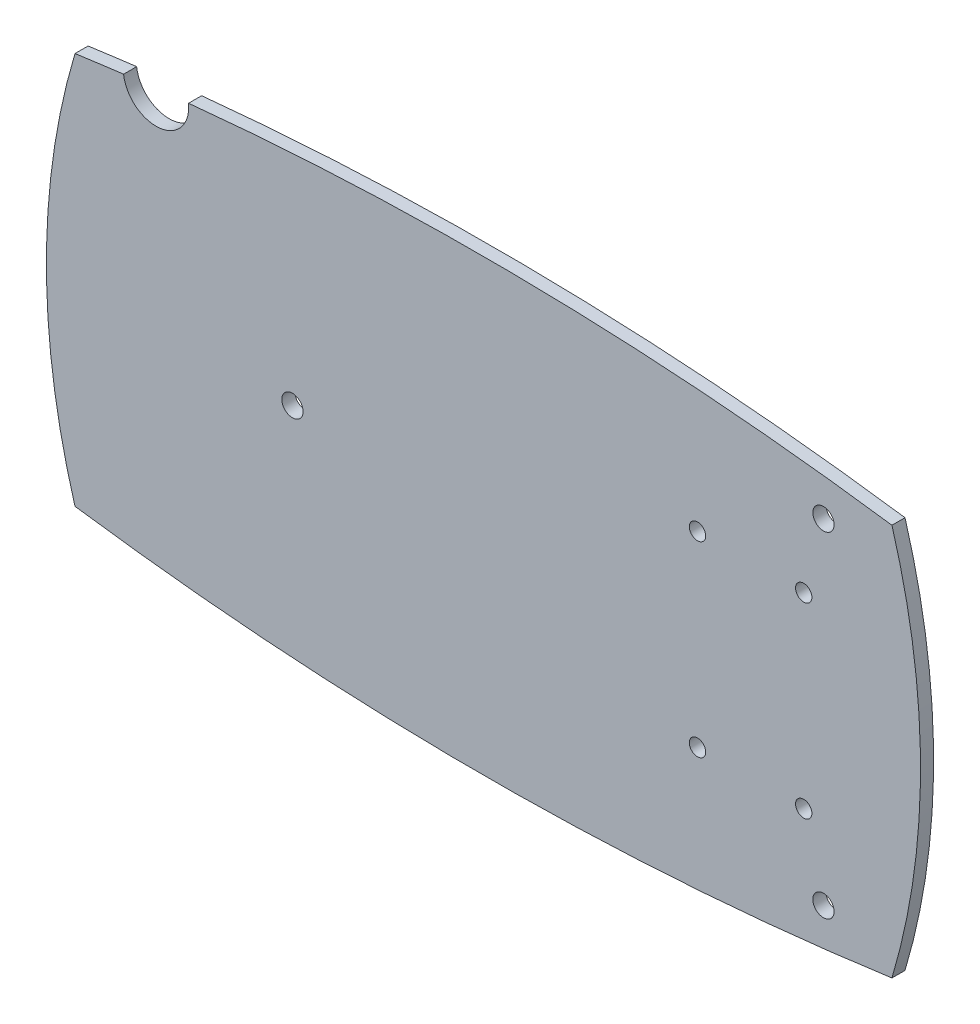
ISO-10303-21;
HEADER;
FILE_DESCRIPTION(('STEP AP214'),'2;1');
FILE_NAME('part.step','',(''),(''),'','','');
FILE_SCHEMA(('AUTOMOTIVE_DESIGN { 1 0 10303 214 1 1 1 1 }'));
ENDSEC;
DATA;
#1=APPLICATION_CONTEXT('core data for automotive mechanical design processes');
#2=APPLICATION_PROTOCOL_DEFINITION('international standard','automotive_design',2000,#1);
#3=PRODUCT_CONTEXT('',#1,'mechanical');
#4=PRODUCT('Part','Part','',(#3));
#5=PRODUCT_RELATED_PRODUCT_CATEGORY('part','',(#4));
#6=PRODUCT_DEFINITION_FORMATION('','',#4);
#7=PRODUCT_DEFINITION_CONTEXT('part definition',#1,'design');
#8=PRODUCT_DEFINITION('design','',#6,#7);
#9=PRODUCT_DEFINITION_SHAPE('','',#8);
#10=(LENGTH_UNIT() NAMED_UNIT(*) SI_UNIT(.MILLI.,.METRE.));
#11=(NAMED_UNIT(*) PLANE_ANGLE_UNIT() SI_UNIT($,.RADIAN.));
#12=(NAMED_UNIT(*) SI_UNIT($,.STERADIAN.) SOLID_ANGLE_UNIT());
#13=UNCERTAINTY_MEASURE_WITH_UNIT(LENGTH_MEASURE(1.E-05),#10,'distance_accuracy_value','');
#14=(GEOMETRIC_REPRESENTATION_CONTEXT(3) GLOBAL_UNCERTAINTY_ASSIGNED_CONTEXT((#13)) GLOBAL_UNIT_ASSIGNED_CONTEXT((#10,
#11,#12)) REPRESENTATION_CONTEXT('',''));
#15=CARTESIAN_POINT('',(0.,0.,0.));
#16=DIRECTION('',(0.,0.,1.));
#17=DIRECTION('',(1.,0.,0.));
#18=AXIS2_PLACEMENT_3D('',#15,#16,#17);
#19=CARTESIAN_POINT('',(-1.184910226,11.2255424561,1.6));
#20=DIRECTION('',(0.,0.,1.));
#21=DIRECTION('',(1.,0.,0.));
#22=AXIS2_PLACEMENT_3D('',#19,#20,#21);
#23=PLANE('',#22);
#24=CARTESIAN_POINT('',(26.6173845785,0.,1.6));
#25=DIRECTION('',(0.,0.,1.));
#26=DIRECTION('',(1.,0.,0.));
#27=AXIS2_PLACEMENT_3D('',#24,#25,#26);
#28=CIRCLE('',#27,1.3);
#29=CARTESIAN_POINT('',(27.9173845785,0.,1.6));
#30=VERTEX_POINT('',#29);
#31=EDGE_CURVE('E122',#30,#30,#28,.F.);
#32=ORIENTED_EDGE('',*,*,#31,.T.);
#33=EDGE_LOOP('',(#32));
#34=FACE_BOUND('',#33,.T.);
#35=CARTESIAN_POINT('',(91.6173845785,20.5,1.60000000083001));
#36=DIRECTION('',(0.,0.,1.));
#37=DIRECTION('',(1.,0.,0.));
#38=AXIS2_PLACEMENT_3D('',#35,#36,#37);
#39=CIRCLE('',#38,1.3);
#40=CARTESIAN_POINT('',(92.9173845785,20.5,1.60000000083001));
#41=VERTEX_POINT('',#40);
#42=EDGE_CURVE('E125',#41,#41,#39,.F.);
#43=ORIENTED_EDGE('',*,*,#42,.T.);
#44=EDGE_LOOP('',(#43));
#45=FACE_BOUND('',#44,.T.);
#46=CARTESIAN_POINT('',(91.6173845785,-20.5,1.60000000083001));
#47=DIRECTION('',(0.,0.,1.));
#48=DIRECTION('',(1.,0.,0.));
#49=AXIS2_PLACEMENT_3D('',#46,#47,#48);
#50=CIRCLE('',#49,1.3);
#51=CARTESIAN_POINT('',(92.9173845785,-20.5,1.60000000083001));
#52=VERTEX_POINT('',#51);
#53=EDGE_CURVE('E128',#52,#52,#50,.F.);
#54=ORIENTED_EDGE('',*,*,#53,.T.);
#55=EDGE_LOOP('',(#54));
#56=FACE_BOUND('',#55,.T.);
#57=CARTESIAN_POINT('',(89.2,-11.45,1.60000000066));
#58=DIRECTION('',(0.,0.,-1.));
#59=DIRECTION('',(-1.,0.,0.));
#60=AXIS2_PLACEMENT_3D('',#57,#58,#59);
#61=CIRCLE('',#60,1.);
#62=CARTESIAN_POINT('',(88.2,-11.45,1.60000000066));
#63=VERTEX_POINT('',#62);
#64=EDGE_CURVE('E131',#63,#63,#61,.T.);
#65=ORIENTED_EDGE('',*,*,#64,.T.);
#66=EDGE_LOOP('',(#65));
#67=FACE_BOUND('',#66,.T.);
#68=CARTESIAN_POINT('',(76.2,-11.45,1.60000000066));
#69=DIRECTION('',(0.,0.,-1.));
#70=DIRECTION('',(-1.,0.,0.));
#71=AXIS2_PLACEMENT_3D('',#68,#69,#70);
#72=CIRCLE('',#71,1.);
#73=CARTESIAN_POINT('',(75.2,-11.45,1.60000000066));
#74=VERTEX_POINT('',#73);
#75=EDGE_CURVE('E134',#74,#74,#72,.T.);
#76=ORIENTED_EDGE('',*,*,#75,.T.);
#77=EDGE_LOOP('',(#76));
#78=FACE_BOUND('',#77,.T.);
#79=CARTESIAN_POINT('',(76.2,11.45,1.60000000066));
#80=DIRECTION('',(0.,0.,-1.));
#81=DIRECTION('',(-1.,0.,0.));
#82=AXIS2_PLACEMENT_3D('',#79,#80,#81);
#83=CIRCLE('',#82,1.);
#84=CARTESIAN_POINT('',(75.2,11.45,1.60000000066));
#85=VERTEX_POINT('',#84);
#86=EDGE_CURVE('E137',#85,#85,#83,.T.);
#87=ORIENTED_EDGE('',*,*,#86,.T.);
#88=EDGE_LOOP('',(#87));
#89=FACE_BOUND('',#88,.T.);
#90=CARTESIAN_POINT('',(89.2,11.45,1.60000000066));
#91=DIRECTION('',(0.,0.,-1.));
#92=DIRECTION('',(-1.,0.,0.));
#93=AXIS2_PLACEMENT_3D('',#90,#91,#92);
#94=CIRCLE('',#93,1.);
#95=CARTESIAN_POINT('',(88.2,11.45,1.60000000066));
#96=VERTEX_POINT('',#95);
#97=EDGE_CURVE('E140',#96,#96,#94,.T.);
#98=ORIENTED_EDGE('',*,*,#97,.T.);
#99=EDGE_LOOP('',(#98));
#100=FACE_BOUND('',#99,.T.);
#101=CARTESIAN_POINT('',(19.4642857143,0.,1.59999999963));
#102=DIRECTION('',(0.,0.,-1.));
#103=DIRECTION('',(-1.,0.,0.));
#104=AXIS2_PLACEMENT_3D('',#101,#102,#103);
#105=CIRCLE('',#104,84.0357142857);
#106=CARTESIAN_POINT('',(99.9999999999995,24.0000000000014,1.59999999963));
#107=VERTEX_POINT('',#106);
#108=CARTESIAN_POINT('',(99.9999999999992,-24.0000000000007,1.59999999963));
#109=VERTEX_POINT('',#108);
#110=EDGE_CURVE('E149',#107,#109,#105,.T.);
#111=ORIENTED_EDGE('',*,*,#110,.F.);
#112=CARTESIAN_POINT('',(50.,-331.392857143,1.6));
#113=DIRECTION('',(0.,0.,1.));
#114=DIRECTION('',(1.,0.,0.));
#115=AXIS2_PLACEMENT_3D('',#112,#113,#114);
#116=CIRCLE('',#115,358.892857143);
#117=CARTESIAN_POINT('',(13.8981014505967,25.6795946499009,1.6));
#118=VERTEX_POINT('',#117);
#119=EDGE_CURVE('E146',#118,#107,#116,.F.);
#120=ORIENTED_EDGE('',*,*,#119,.F.);
#121=CARTESIAN_POINT('',(9.92069465196,25.2550535351,1.6));
#122=DIRECTION('',(0.,0.,-1.));
#123=DIRECTION('',(-1.,0.,0.));
#124=AXIS2_PLACEMENT_3D('',#121,#122,#123);
#125=CIRCLE('',#124,4.);
#126=CARTESIAN_POINT('',(5.94826649118717,24.7862097364879,1.59999999981499));
#127=VERTEX_POINT('',#126);
#128=EDGE_CURVE('E81',#118,#127,#125,.T.);
#129=ORIENTED_EDGE('',*,*,#128,.T.);
#130=CARTESIAN_POINT('',(50.,-331.392857143,1.59999999963));
#131=DIRECTION('',(0.,0.,1.));
#132=DIRECTION('',(1.,0.,0.));
#133=AXIS2_PLACEMENT_3D('',#130,#131,#132);
#134=CIRCLE('',#133,358.892857143);
#135=CARTESIAN_POINT('',(8.11850586757146E-13,24.0000000000007,1.59999999963));
#136=VERTEX_POINT('',#135);
#137=EDGE_CURVE('E20',#136,#127,#134,.F.);
#138=ORIENTED_EDGE('',*,*,#137,.F.);
#139=CARTESIAN_POINT('',(80.5357142857,0.,1.59999999963));
#140=DIRECTION('',(0.,0.,1.));
#141=DIRECTION('',(1.,0.,0.));
#142=AXIS2_PLACEMENT_3D('',#139,#140,#141);
#143=CIRCLE('',#142,84.0357142857);
#144=CARTESIAN_POINT('',(5.96744875736022E-13,-24.0000000000014,1.59999999963));
#145=VERTEX_POINT('',#144);
#146=EDGE_CURVE('E67',#145,#136,#143,.F.);
#147=ORIENTED_EDGE('',*,*,#146,.F.);
#148=CARTESIAN_POINT('',(50.,331.392857143,1.59999999963));
#149=DIRECTION('',(0.,0.,-1.));
#150=DIRECTION('',(-1.,0.,0.));
#151=AXIS2_PLACEMENT_3D('',#148,#149,#150);
#152=CIRCLE('',#151,358.892857143);
#153=EDGE_CURVE('E89',#109,#145,#152,.T.);
#154=ORIENTED_EDGE('',*,*,#153,.F.);
#155=EDGE_LOOP('',(#111,#120,#129,#138,#147,#154));
#156=FACE_BOUND('',#155,.T.);
#157=ADVANCED_FACE('F17',(#34,#45,#56,#67,#78,#89,#100,#156),#23,.T.);
#158=CARTESIAN_POINT('',(50.,-331.392857143,0.));
#159=DIRECTION('',(0.,0.,1.));
#160=DIRECTION('',(1.,0.,0.));
#161=AXIS2_PLACEMENT_3D('',#158,#159,#160);
#162=CYLINDRICAL_SURFACE('',#161,358.892857143);
#163=DIRECTION('',(0.,0.,1.));
#164=VECTOR('',#163,1.);
#165=CARTESIAN_POINT('',(5.55111512312578E-13,23.9999999999998,0.));
#166=LINE('',#165,#164);
#167=CARTESIAN_POINT('',(8.11850586757146E-13,24.0000000000007,1.77024438456849E-10));
#168=VERTEX_POINT('',#167);
#169=EDGE_CURVE('E72',#136,#168,#166,.F.);
#170=ORIENTED_EDGE('',*,*,#169,.F.);
#171=ORIENTED_EDGE('',*,*,#137,.T.);
#172=DIRECTION('',(0.,0.,-1.));
#173=VECTOR('',#172,1.);
#174=CARTESIAN_POINT('',(5.94826649118556,24.7862097364995,1.6));
#175=LINE('',#174,#173);
#176=CARTESIAN_POINT('',(5.94826649118717,24.7862097364879,3.7252904754258E-10));
#177=VERTEX_POINT('',#176);
#178=EDGE_CURVE('E143',#127,#177,#175,.T.);
#179=ORIENTED_EDGE('',*,*,#178,.T.);
#180=CARTESIAN_POINT('',(50.,-331.392857143,3.72529118664E-10));
#181=DIRECTION('',(0.,0.,1.));
#182=DIRECTION('',(1.,0.,0.));
#183=AXIS2_PLACEMENT_3D('',#180,#181,#182);
#184=CIRCLE('',#183,358.892857143);
#185=EDGE_CURVE('E87',#177,#168,#184,.T.);
#186=ORIENTED_EDGE('',*,*,#185,.T.);
#187=EDGE_LOOP('',(#170,#171,#179,#186));
#188=FACE_BOUND('',#187,.T.);
#189=ADVANCED_FACE('F86',(#188),#162,.T.);
#190=CARTESIAN_POINT('',(80.5357142857,0.,0.));
#191=DIRECTION('',(0.,0.,1.));
#192=DIRECTION('',(1.,0.,0.));
#193=AXIS2_PLACEMENT_3D('',#190,#191,#192);
#194=CYLINDRICAL_SURFACE('',#193,84.0357142857);
#195=CARTESIAN_POINT('',(80.5357142857,0.,0.));
#196=DIRECTION('',(0.,0.,1.));
#197=DIRECTION('',(1.,0.,0.));
#198=AXIS2_PLACEMENT_3D('',#195,#196,#197);
#199=CIRCLE('',#198,84.0357142857);
#200=CARTESIAN_POINT('',(5.96744875736022E-13,-24.0000000000014,0.));
#201=VERTEX_POINT('',#200);
#202=EDGE_CURVE('E119',#168,#201,#199,.T.);
#203=ORIENTED_EDGE('',*,*,#202,.T.);
#204=DIRECTION('',(0.,0.,-1.));
#205=VECTOR('',#204,1.);
#206=CARTESIAN_POINT('',(0.,-24.0000000000014,0.));
#207=LINE('',#206,#205);
#208=EDGE_CURVE('E74',#145,#201,#207,.T.);
#209=ORIENTED_EDGE('',*,*,#208,.F.);
#210=ORIENTED_EDGE('',*,*,#146,.T.);
#211=ORIENTED_EDGE('',*,*,#169,.T.);
#212=EDGE_LOOP('',(#203,#209,#210,#211));
#213=FACE_BOUND('',#212,.T.);
#214=ADVANCED_FACE('F70',(#213),#194,.T.);
#215=CARTESIAN_POINT('',(50.,331.392857143,0.));
#216=DIRECTION('',(0.,0.,-1.));
#217=DIRECTION('',(-1.,0.,0.));
#218=AXIS2_PLACEMENT_3D('',#215,#216,#217);
#219=CYLINDRICAL_SURFACE('',#218,358.892857143);
#220=DIRECTION('',(0.,0.,-1.));
#221=VECTOR('',#220,1.);
#222=CARTESIAN_POINT('',(99.9999999999994,-23.9999999999998,0.));
#223=LINE('',#222,#221);
#224=CARTESIAN_POINT('',(99.9999999999992,-24.0000000000007,0.));
#225=VERTEX_POINT('',#224);
#226=EDGE_CURVE('E151',#109,#225,#223,.T.);
#227=ORIENTED_EDGE('',*,*,#226,.F.);
#228=ORIENTED_EDGE('',*,*,#153,.T.);
#229=ORIENTED_EDGE('',*,*,#208,.T.);
#230=CARTESIAN_POINT('',(50.,331.392857143,0.));
#231=DIRECTION('',(0.,0.,-1.));
#232=DIRECTION('',(-1.,0.,0.));
#233=AXIS2_PLACEMENT_3D('',#230,#231,#232);
#234=CIRCLE('',#233,358.892857143);
#235=EDGE_CURVE('E117',#201,#225,#234,.F.);
#236=ORIENTED_EDGE('',*,*,#235,.T.);
#237=EDGE_LOOP('',(#227,#228,#229,#236));
#238=FACE_BOUND('',#237,.T.);
#239=ADVANCED_FACE('F154',(#238),#219,.T.);
#240=CARTESIAN_POINT('',(19.4642857143,0.,0.));
#241=DIRECTION('',(0.,0.,-1.));
#242=DIRECTION('',(-1.,0.,0.));
#243=AXIS2_PLACEMENT_3D('',#240,#241,#242);
#244=CYLINDRICAL_SURFACE('',#243,84.0357142857);
#245=CARTESIAN_POINT('',(19.4642857143,0.,0.));
#246=DIRECTION('',(0.,0.,-1.));
#247=DIRECTION('',(-1.,0.,0.));
#248=AXIS2_PLACEMENT_3D('',#245,#246,#247);
#249=CIRCLE('',#248,84.0357142857);
#250=CARTESIAN_POINT('',(99.9999999999995,24.0000000000014,0.));
#251=VERTEX_POINT('',#250);
#252=EDGE_CURVE('E114',#225,#251,#249,.F.);
#253=ORIENTED_EDGE('',*,*,#252,.T.);
#254=DIRECTION('',(0.,0.,1.));
#255=VECTOR('',#254,1.);
#256=CARTESIAN_POINT('',(100.,24.0000000000014,0.));
#257=LINE('',#256,#255);
#258=EDGE_CURVE('E148',#107,#251,#257,.F.);
#259=ORIENTED_EDGE('',*,*,#258,.F.);
#260=ORIENTED_EDGE('',*,*,#110,.T.);
#261=ORIENTED_EDGE('',*,*,#226,.T.);
#262=EDGE_LOOP('',(#253,#259,#260,#261));
#263=FACE_BOUND('',#262,.T.);
#264=ADVANCED_FACE('F159',(#263),#244,.T.);
#265=CARTESIAN_POINT('',(50.,-331.392857143,0.));
#266=DIRECTION('',(0.,0.,1.));
#267=DIRECTION('',(1.,0.,0.));
#268=AXIS2_PLACEMENT_3D('',#265,#266,#267);
#269=CYLINDRICAL_SURFACE('',#268,358.892857143);
#270=DIRECTION('',(0.,0.,-1.));
#271=VECTOR('',#270,1.);
#272=CARTESIAN_POINT('',(13.8981014505971,25.6795946498997,1.6));
#273=LINE('',#272,#271);
#274=CARTESIAN_POINT('',(13.8981014505971,25.6795946498997,1.86264523770185E-10));
#275=VERTEX_POINT('',#274);
#276=EDGE_CURVE('E145',#275,#118,#273,.F.);
#277=ORIENTED_EDGE('',*,*,#276,.T.);
#278=ORIENTED_EDGE('',*,*,#119,.T.);
#279=ORIENTED_EDGE('',*,*,#258,.T.);
#280=CARTESIAN_POINT('',(50.,-331.392857143,0.));
#281=DIRECTION('',(0.,0.,1.));
#282=DIRECTION('',(1.,0.,0.));
#283=AXIS2_PLACEMENT_3D('',#280,#281,#282);
#284=CIRCLE('',#283,358.892857143);
#285=EDGE_CURVE('E35',#251,#275,#284,.T.);
#286=ORIENTED_EDGE('',*,*,#285,.T.);
#287=EDGE_LOOP('',(#277,#278,#279,#286));
#288=FACE_BOUND('',#287,.T.);
#289=ADVANCED_FACE('F208',(#288),#269,.T.);
#290=CARTESIAN_POINT('',(9.92069465196,25.2550535351,1.6));
#291=DIRECTION('',(0.,0.,-1.));
#292=DIRECTION('',(-1.,0.,0.));
#293=AXIS2_PLACEMENT_3D('',#290,#291,#292);
#294=CYLINDRICAL_SURFACE('',#293,4.);
#295=ORIENTED_EDGE('',*,*,#178,.F.);
#296=ORIENTED_EDGE('',*,*,#128,.F.);
#297=ORIENTED_EDGE('',*,*,#276,.F.);
#298=CARTESIAN_POINT('',(9.92069465196,25.2550535351,3.72529047540371E-10));
#299=DIRECTION('',(0.,0.,-1.));
#300=DIRECTION('',(-1.,0.,0.));
#301=AXIS2_PLACEMENT_3D('',#298,#299,#300);
#302=CIRCLE('',#301,4.);
#303=EDGE_CURVE('E110',#275,#177,#302,.T.);
#304=ORIENTED_EDGE('',*,*,#303,.T.);
#305=EDGE_LOOP('',(#295,#296,#297,#304));
#306=FACE_BOUND('',#305,.T.);
#307=ADVANCED_FACE('F166',(#306),#294,.F.);
#308=CARTESIAN_POINT('',(89.2,11.45,120.318577119));
#309=DIRECTION('',(0.,0.,-1.));
#310=DIRECTION('',(-1.,0.,0.));
#311=AXIS2_PLACEMENT_3D('',#308,#309,#310);
#312=CYLINDRICAL_SURFACE('',#311,1.);
#313=CARTESIAN_POINT('',(89.2,11.45,-8.34582403186346E-10));
#314=DIRECTION('',(0.,0.,-1.));
#315=DIRECTION('',(-1.,0.,0.));
#316=AXIS2_PLACEMENT_3D('',#313,#314,#315);
#317=CIRCLE('',#316,1.);
#318=CARTESIAN_POINT('',(88.2,11.45,-8.34582403186346E-10));
#319=VERTEX_POINT('',#318);
#320=EDGE_CURVE('E107',#319,#319,#317,.T.);
#321=ORIENTED_EDGE('',*,*,#320,.T.);
#322=EDGE_LOOP('',(#321));
#323=FACE_BOUND('',#322,.T.);
#324=ORIENTED_EDGE('',*,*,#97,.F.);
#325=EDGE_LOOP('',(#324));
#326=FACE_BOUND('',#325,.T.);
#327=ADVANCED_FACE('F201',(#323,#326),#312,.F.);
#328=CARTESIAN_POINT('',(76.2,11.45,120.318577119));
#329=DIRECTION('',(0.,0.,-1.));
#330=DIRECTION('',(-1.,0.,0.));
#331=AXIS2_PLACEMENT_3D('',#328,#329,#330);
#332=CYLINDRICAL_SURFACE('',#331,1.);
#333=CARTESIAN_POINT('',(76.2,11.45,-8.34582403186346E-10));
#334=DIRECTION('',(0.,0.,-1.));
#335=DIRECTION('',(-1.,0.,0.));
#336=AXIS2_PLACEMENT_3D('',#333,#334,#335);
#337=CIRCLE('',#336,1.);
#338=CARTESIAN_POINT('',(75.2,11.45,-8.34582403186346E-10));
#339=VERTEX_POINT('',#338);
#340=EDGE_CURVE('E104',#339,#339,#337,.T.);
#341=ORIENTED_EDGE('',*,*,#340,.T.);
#342=EDGE_LOOP('',(#341));
#343=FACE_BOUND('',#342,.T.);
#344=ORIENTED_EDGE('',*,*,#86,.F.);
#345=EDGE_LOOP('',(#344));
#346=FACE_BOUND('',#345,.T.);
#347=ADVANCED_FACE('F197',(#343,#346),#332,.F.);
#348=CARTESIAN_POINT('',(76.2,-11.45,120.318577119));
#349=DIRECTION('',(0.,0.,-1.));
#350=DIRECTION('',(-1.,0.,0.));
#351=AXIS2_PLACEMENT_3D('',#348,#349,#350);
#352=CYLINDRICAL_SURFACE('',#351,1.);
#353=CARTESIAN_POINT('',(76.2,-11.45,-8.34582403186346E-10));
#354=DIRECTION('',(0.,0.,-1.));
#355=DIRECTION('',(-1.,0.,0.));
#356=AXIS2_PLACEMENT_3D('',#353,#354,#355);
#357=CIRCLE('',#356,1.);
#358=CARTESIAN_POINT('',(75.2,-11.45,-8.34582403186346E-10));
#359=VERTEX_POINT('',#358);
#360=EDGE_CURVE('E101',#359,#359,#357,.T.);
#361=ORIENTED_EDGE('',*,*,#360,.T.);
#362=EDGE_LOOP('',(#361));
#363=FACE_BOUND('',#362,.T.);
#364=ORIENTED_EDGE('',*,*,#75,.F.);
#365=EDGE_LOOP('',(#364));
#366=FACE_BOUND('',#365,.T.);
#367=ADVANCED_FACE('F193',(#363,#366),#352,.F.);
#368=CARTESIAN_POINT('',(89.2,-11.45,120.318577119));
#369=DIRECTION('',(0.,0.,-1.));
#370=DIRECTION('',(-1.,0.,0.));
#371=AXIS2_PLACEMENT_3D('',#368,#369,#370);
#372=CYLINDRICAL_SURFACE('',#371,1.);
#373=CARTESIAN_POINT('',(89.2,-11.45,-8.34582403186346E-10));
#374=DIRECTION('',(0.,0.,-1.));
#375=DIRECTION('',(-1.,0.,0.));
#376=AXIS2_PLACEMENT_3D('',#373,#374,#375);
#377=CIRCLE('',#376,1.);
#378=CARTESIAN_POINT('',(88.2,-11.45,-8.34582403186346E-10));
#379=VERTEX_POINT('',#378);
#380=EDGE_CURVE('E98',#379,#379,#377,.T.);
#381=ORIENTED_EDGE('',*,*,#380,.T.);
#382=EDGE_LOOP('',(#381));
#383=FACE_BOUND('',#382,.T.);
#384=ORIENTED_EDGE('',*,*,#64,.F.);
#385=EDGE_LOOP('',(#384));
#386=FACE_BOUND('',#385,.T.);
#387=ADVANCED_FACE('F189',(#383,#386),#372,.F.);
#388=CARTESIAN_POINT('',(91.6173845785,-20.5,-118.718577119));
#389=DIRECTION('',(0.,0.,1.));
#390=DIRECTION('',(1.,0.,0.));
#391=AXIS2_PLACEMENT_3D('',#388,#389,#390);
#392=CYLINDRICAL_SURFACE('',#391,1.3);
#393=ORIENTED_EDGE('',*,*,#53,.F.);
#394=EDGE_LOOP('',(#393));
#395=FACE_BOUND('',#394,.T.);
#396=CARTESIAN_POINT('',(91.6173845785,-20.5,-6.55531184889924E-10));
#397=DIRECTION('',(0.,0.,1.));
#398=DIRECTION('',(1.,0.,0.));
#399=AXIS2_PLACEMENT_3D('',#396,#397,#398);
#400=CIRCLE('',#399,1.3);
#401=CARTESIAN_POINT('',(92.9173845785,-20.5,-6.55531184889924E-10));
#402=VERTEX_POINT('',#401);
#403=EDGE_CURVE('E95',#402,#402,#400,.F.);
#404=ORIENTED_EDGE('',*,*,#403,.T.);
#405=EDGE_LOOP('',(#404));
#406=FACE_BOUND('',#405,.T.);
#407=ADVANCED_FACE('F185',(#395,#406),#392,.F.);
#408=CARTESIAN_POINT('',(91.6173845785,20.5,-118.718577119));
#409=DIRECTION('',(0.,0.,1.));
#410=DIRECTION('',(1.,0.,0.));
#411=AXIS2_PLACEMENT_3D('',#408,#409,#410);
#412=CYLINDRICAL_SURFACE('',#411,1.3);
#413=ORIENTED_EDGE('',*,*,#42,.F.);
#414=EDGE_LOOP('',(#413));
#415=FACE_BOUND('',#414,.T.);
#416=CARTESIAN_POINT('',(91.6173845785,20.5,-6.55531184889924E-10));
#417=DIRECTION('',(0.,0.,1.));
#418=DIRECTION('',(1.,0.,0.));
#419=AXIS2_PLACEMENT_3D('',#416,#417,#418);
#420=CIRCLE('',#419,1.3);
#421=CARTESIAN_POINT('',(92.9173845785,20.5,-6.55531184889924E-10));
#422=VERTEX_POINT('',#421);
#423=EDGE_CURVE('E26',#422,#422,#420,.F.);
#424=ORIENTED_EDGE('',*,*,#423,.T.);
#425=EDGE_LOOP('',(#424));
#426=FACE_BOUND('',#425,.T.);
#427=ADVANCED_FACE('F177',(#415,#426),#412,.F.);
#428=CARTESIAN_POINT('',(26.6173845785,0.,-118.718577119));
#429=DIRECTION('',(0.,0.,1.));
#430=DIRECTION('',(1.,0.,0.));
#431=AXIS2_PLACEMENT_3D('',#428,#429,#430);
#432=CYLINDRICAL_SURFACE('',#431,1.3);
#433=ORIENTED_EDGE('',*,*,#31,.F.);
#434=EDGE_LOOP('',(#433));
#435=FACE_BOUND('',#434,.T.);
#436=CARTESIAN_POINT('',(26.6173845785,0.,-6.55531184889924E-10));
#437=DIRECTION('',(0.,0.,1.));
#438=DIRECTION('',(1.,0.,0.));
#439=AXIS2_PLACEMENT_3D('',#436,#437,#438);
#440=CIRCLE('',#439,1.3);
#441=CARTESIAN_POINT('',(27.9173845785,0.,-6.55531184889924E-10));
#442=VERTEX_POINT('',#441);
#443=EDGE_CURVE('E11',#442,#442,#440,.F.);
#444=ORIENTED_EDGE('',*,*,#443,.T.);
#445=EDGE_LOOP('',(#444));
#446=FACE_BOUND('',#445,.T.);
#447=ADVANCED_FACE('F170',(#435,#446),#432,.F.);
#448=CARTESIAN_POINT('',(-1.184910226,11.2255424561,0.));
#449=DIRECTION('',(0.,0.,1.));
#450=DIRECTION('',(1.,0.,0.));
#451=AXIS2_PLACEMENT_3D('',#448,#449,#450);
#452=PLANE('',#451);
#453=ORIENTED_EDGE('',*,*,#443,.F.);
#454=EDGE_LOOP('',(#453));
#455=FACE_BOUND('',#454,.T.);
#456=ORIENTED_EDGE('',*,*,#423,.F.);
#457=EDGE_LOOP('',(#456));
#458=FACE_BOUND('',#457,.T.);
#459=ORIENTED_EDGE('',*,*,#403,.F.);
#460=EDGE_LOOP('',(#459));
#461=FACE_BOUND('',#460,.T.);
#462=ORIENTED_EDGE('',*,*,#380,.F.);
#463=EDGE_LOOP('',(#462));
#464=FACE_BOUND('',#463,.T.);
#465=ORIENTED_EDGE('',*,*,#360,.F.);
#466=EDGE_LOOP('',(#465));
#467=FACE_BOUND('',#466,.T.);
#468=ORIENTED_EDGE('',*,*,#340,.F.);
#469=EDGE_LOOP('',(#468));
#470=FACE_BOUND('',#469,.T.);
#471=ORIENTED_EDGE('',*,*,#320,.F.);
#472=EDGE_LOOP('',(#471));
#473=FACE_BOUND('',#472,.T.);
#474=ORIENTED_EDGE('',*,*,#303,.F.);
#475=ORIENTED_EDGE('',*,*,#285,.F.);
#476=ORIENTED_EDGE('',*,*,#252,.F.);
#477=ORIENTED_EDGE('',*,*,#235,.F.);
#478=ORIENTED_EDGE('',*,*,#202,.F.);
#479=ORIENTED_EDGE('',*,*,#185,.F.);
#480=EDGE_LOOP('',(#474,#475,#476,#477,#478,#479));
#481=FACE_BOUND('',#480,.T.);
#482=ADVANCED_FACE('F168',(#455,#458,#461,#464,#467,#470,#473,#481),#452,.F.);
#483=CLOSED_SHELL('',(#157,#189,#214,#239,#264,#289,#307,#327,#347,#367,#387,#407,#427,#447,#482));
#484=MANIFOLD_SOLID_BREP('B1',#483);
#485=ADVANCED_BREP_SHAPE_REPRESENTATION('',(#18,#484),#14);
#486=SHAPE_DEFINITION_REPRESENTATION(#9,#485);
ENDSEC;
END-ISO-10303-21;
